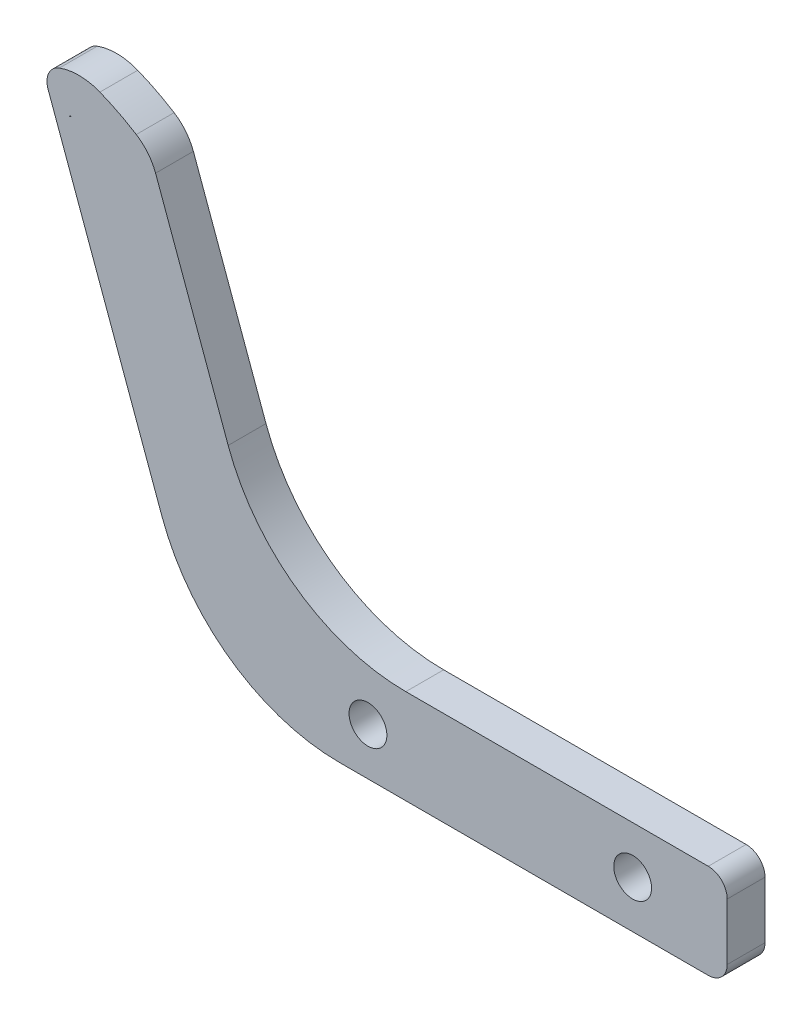
ISO-10303-21;
HEADER;
FILE_DESCRIPTION(('STEP AP214'),'2;1');
FILE_NAME('part.step','',(''),(''),'','','');
FILE_SCHEMA(('AUTOMOTIVE_DESIGN { 1 0 10303 214 1 1 1 1 }'));
ENDSEC;
DATA;
#1=APPLICATION_CONTEXT('core data for automotive mechanical design processes');
#2=APPLICATION_PROTOCOL_DEFINITION('international standard','automotive_design',2000,#1);
#3=PRODUCT_CONTEXT('',#1,'mechanical');
#4=PRODUCT('Part','Part','',(#3));
#5=PRODUCT_RELATED_PRODUCT_CATEGORY('part','',(#4));
#6=PRODUCT_DEFINITION_FORMATION('','',#4);
#7=PRODUCT_DEFINITION_CONTEXT('part definition',#1,'design');
#8=PRODUCT_DEFINITION('design','',#6,#7);
#9=PRODUCT_DEFINITION_SHAPE('','',#8);
#10=(LENGTH_UNIT() NAMED_UNIT(*) SI_UNIT(.MILLI.,.METRE.));
#11=(NAMED_UNIT(*) PLANE_ANGLE_UNIT() SI_UNIT($,.RADIAN.));
#12=(NAMED_UNIT(*) SI_UNIT($,.STERADIAN.) SOLID_ANGLE_UNIT());
#13=UNCERTAINTY_MEASURE_WITH_UNIT(LENGTH_MEASURE(1.E-05),#10,'distance_accuracy_value','');
#14=(GEOMETRIC_REPRESENTATION_CONTEXT(3) GLOBAL_UNCERTAINTY_ASSIGNED_CONTEXT((#13)) GLOBAL_UNIT_ASSIGNED_CONTEXT((#10,
#11,#12)) REPRESENTATION_CONTEXT('',''));
#15=CARTESIAN_POINT('',(0.,0.,0.));
#16=DIRECTION('',(0.,0.,1.));
#17=DIRECTION('',(1.,0.,0.));
#18=AXIS2_PLACEMENT_3D('',#15,#16,#17);
#19=CARTESIAN_POINT('',(-58.5846758968649,38.1711990775723,-4.));
#20=DIRECTION('',(0.,0.,1.));
#21=DIRECTION('',(-1.,0.,0.));
#22=AXIS2_PLACEMENT_3D('',#19,#20,#21);
#23=CYLINDRICAL_SURFACE('',#22,2.);
#24=CARTESIAN_POINT('',(-58.5846758968649,38.1711990775723,0.));
#25=DIRECTION('',(0.,0.,1.));
#26=DIRECTION('',(1.,0.,0.));
#27=AXIS2_PLACEMENT_3D('',#24,#25,#26);
#28=CIRCLE('',#27,2.);
#29=CARTESIAN_POINT('',(-59.572682652042,39.9101190445991,0.));
#30=VERTEX_POINT('',#29);
#31=CARTESIAN_POINT('',(-59.2687161835162,40.0505843191441,0.));
#32=VERTEX_POINT('',#31);
#33=EDGE_CURVE('E172',#30,#32,#28,.F.);
#34=ORIENTED_EDGE('',*,*,#33,.T.);
#35=DIRECTION('',(0.,0.,-1.));
#36=VECTOR('',#35,1.);
#37=CARTESIAN_POINT('',(-59.2687161835162,40.0505843191441,0.));
#38=LINE('',#37,#36);
#39=CARTESIAN_POINT('',(-59.2687161835162,40.0505843191441,-4.));
#40=VERTEX_POINT('',#39);
#41=EDGE_CURVE('E159',#32,#40,#38,.T.);
#42=ORIENTED_EDGE('',*,*,#41,.T.);
#43=CARTESIAN_POINT('',(-58.5846758968649,38.1711990775723,-4.));
#44=DIRECTION('',(0.,0.,1.));
#45=DIRECTION('',(1.,0.,0.));
#46=AXIS2_PLACEMENT_3D('',#43,#44,#45);
#47=CIRCLE('',#46,2.);
#48=CARTESIAN_POINT('',(-59.572682652042,39.9101190445991,-4.));
#49=VERTEX_POINT('',#48);
#50=EDGE_CURVE('E287',#40,#49,#47,.T.);
#51=ORIENTED_EDGE('',*,*,#50,.T.);
#52=DIRECTION('',(0.,0.,-1.));
#53=VECTOR('',#52,1.);
#54=CARTESIAN_POINT('',(-59.572682652042,39.9101190445991,0.));
#55=LINE('',#54,#53);
#56=EDGE_CURVE('E197',#30,#49,#55,.T.);
#57=ORIENTED_EDGE('',*,*,#56,.F.);
#58=EDGE_LOOP('',(#34,#42,#51,#57));
#59=FACE_BOUND('',#58,.T.);
#60=ADVANCED_FACE('F39',(#59),#23,.T.);
#61=CARTESIAN_POINT('',(-31.9460427865344,-11.6274086768929,-4.));
#62=DIRECTION('',(0.93969262078591,0.342020143325665,0.));
#63=DIRECTION('',(-0.342020143325665,0.93969262078591,0.));
#64=AXIS2_PLACEMENT_3D('',#61,#62,#63);
#65=PLANE('',#64);
#66=DIRECTION('',(0.342020143325665,-0.93969262078591,0.));
#67=VECTOR('',#66,1.);
#68=CARTESIAN_POINT('',(-31.9460427865344,-11.6274086768929,0.));
#69=LINE('',#68,#67);
#70=CARTESIAN_POINT('',(-50.4670591952752,39.2586656914718,0.));
#71=VERTEX_POINT('',#70);
#72=CARTESIAN_POINT('',(-42.7876262694269,18.1595971334867,0.));
#73=VERTEX_POINT('',#72);
#74=EDGE_CURVE('E233',#71,#73,#69,.T.);
#75=ORIENTED_EDGE('',*,*,#74,.T.);
#76=DIRECTION('',(0.,0.,1.));
#77=VECTOR('',#76,1.);
#78=CARTESIAN_POINT('',(-42.7876262694268,18.1595971334867,0.));
#79=LINE('',#78,#77);
#80=CARTESIAN_POINT('',(-42.7876262694269,18.1595971334867,-4.));
#81=VERTEX_POINT('',#80);
#82=EDGE_CURVE('E264',#81,#73,#79,.T.);
#83=ORIENTED_EDGE('',*,*,#82,.F.);
#84=DIRECTION('',(0.342020143325665,-0.93969262078591,0.));
#85=VECTOR('',#84,1.);
#86=CARTESIAN_POINT('',(-31.9460427865344,-11.6274086768929,-4.));
#87=LINE('',#86,#85);
#88=CARTESIAN_POINT('',(-50.4670591952752,39.2586656914718,-4.));
#89=VERTEX_POINT('',#88);
#90=EDGE_CURVE('E213',#89,#81,#87,.T.);
#91=ORIENTED_EDGE('',*,*,#90,.F.);
#92=DIRECTION('',(0.,0.,-1.));
#93=VECTOR('',#92,1.);
#94=CARTESIAN_POINT('',(-50.4670591952752,39.2586656914718,0.));
#95=LINE('',#94,#93);
#96=EDGE_CURVE('E209',#71,#89,#95,.T.);
#97=ORIENTED_EDGE('',*,*,#96,.F.);
#98=EDGE_LOOP('',(#75,#83,#91,#97));
#99=FACE_BOUND('',#98,.T.);
#100=ADVANCED_FACE('F334',(#99),#65,.T.);
#101=CARTESIAN_POINT('',(-41.3429689943934,-15.0476101101496,-4.));
#102=DIRECTION('',(0.939692620785909,0.342020143325666,0.));
#103=DIRECTION('',(-0.342020143325666,0.939692620785909,0.));
#104=AXIS2_PLACEMENT_3D('',#101,#102,#103);
#105=PLANE('',#104);
#106=DIRECTION('',(0.342020143325666,-0.939692620785909,0.));
#107=VECTOR('',#106,1.);
#108=CARTESIAN_POINT('',(-41.3429689943934,-15.0476101101496,-4.));
#109=LINE('',#108,#107);
#110=CARTESIAN_POINT('',(-61.8321417117394,41.2459292740646,-4.));
#111=VERTEX_POINT('',#110);
#112=CARTESIAN_POINT('',(-49.789701651524,8.15959713348668,-4.));
#113=VERTEX_POINT('',#112);
#114=EDGE_CURVE('E216',#111,#113,#109,.T.);
#115=ORIENTED_EDGE('',*,*,#114,.T.);
#116=DIRECTION('',(0.,0.,1.));
#117=VECTOR('',#116,1.);
#118=CARTESIAN_POINT('',(-49.789701651524,8.15959713348668,-4.));
#119=LINE('',#118,#117);
#120=CARTESIAN_POINT('',(-49.789701651524,8.15959713348668,0.));
#121=VERTEX_POINT('',#120);
#122=EDGE_CURVE('E259',#121,#113,#119,.F.);
#123=ORIENTED_EDGE('',*,*,#122,.F.);
#124=DIRECTION('',(0.342020143325666,-0.939692620785909,0.));
#125=VECTOR('',#124,1.);
#126=CARTESIAN_POINT('',(-41.3429689943934,-15.0476101101496,0.));
#127=LINE('',#126,#125);
#128=CARTESIAN_POINT('',(-61.8321417117394,41.2459292740646,0.));
#129=VERTEX_POINT('',#128);
#130=EDGE_CURVE('E236',#129,#121,#127,.T.);
#131=ORIENTED_EDGE('',*,*,#130,.F.);
#132=DIRECTION('',(0.,0.,-1.));
#133=VECTOR('',#132,1.);
#134=CARTESIAN_POINT('',(-61.8321417117394,41.2459292740646,0.));
#135=LINE('',#134,#133);
#136=EDGE_CURVE('E200',#129,#111,#135,.T.);
#137=ORIENTED_EDGE('',*,*,#136,.T.);
#138=EDGE_LOOP('',(#115,#123,#131,#137));
#139=FACE_BOUND('',#138,.T.);
#140=ADVANCED_FACE('F315',(#139),#105,.F.);
#141=CARTESIAN_POINT('',(0.,-5.,-4.));
#142=DIRECTION('',(0.,1.,0.));
#143=DIRECTION('',(0.,0.,-1.));
#144=AXIS2_PLACEMENT_3D('',#141,#142,#143);
#145=PLANE('',#144);
#146=DIRECTION('',(1.,0.,0.));
#147=VECTOR('',#146,1.);
#148=CARTESIAN_POINT('',(0.,-5.,0.));
#149=LINE('',#148,#147);
#150=CARTESIAN_POINT('',(-30.9958492358058,-5.,0.));
#151=VERTEX_POINT('',#150);
#152=CARTESIAN_POINT('',(8.,-5.,0.));
#153=VERTEX_POINT('',#152);
#154=EDGE_CURVE('E240',#151,#153,#149,.T.);
#155=ORIENTED_EDGE('',*,*,#154,.F.);
#156=DIRECTION('',(0.,0.,1.));
#157=VECTOR('',#156,1.);
#158=CARTESIAN_POINT('',(-30.9958492358058,-5.,-4.));
#159=LINE('',#158,#157);
#160=CARTESIAN_POINT('',(-30.9958492358058,-5.,-4.));
#161=VERTEX_POINT('',#160);
#162=EDGE_CURVE('E232',#161,#151,#159,.T.);
#163=ORIENTED_EDGE('',*,*,#162,.F.);
#164=DIRECTION('',(1.,0.,0.));
#165=VECTOR('',#164,1.);
#166=CARTESIAN_POINT('',(0.,-5.,-4.));
#167=LINE('',#166,#165);
#168=CARTESIAN_POINT('',(8.,-5.,-4.));
#169=VERTEX_POINT('',#168);
#170=EDGE_CURVE('E220',#161,#169,#167,.T.);
#171=ORIENTED_EDGE('',*,*,#170,.T.);
#172=DIRECTION('',(0.,0.,1.));
#173=VECTOR('',#172,1.);
#174=CARTESIAN_POINT('',(8.,-5.,-4.));
#175=LINE('',#174,#173);
#176=EDGE_CURVE('E284',#153,#169,#175,.F.);
#177=ORIENTED_EDGE('',*,*,#176,.F.);
#178=EDGE_LOOP('',(#155,#163,#171,#177));
#179=FACE_BOUND('',#178,.T.);
#180=ADVANCED_FACE('F307',(#179),#145,.F.);
#181=CARTESIAN_POINT('',(-28.,0.,-4.));
#182=DIRECTION('',(0.,0.,1.));
#183=DIRECTION('',(-1.,0.,0.));
#184=AXIS2_PLACEMENT_3D('',#181,#182,#183);
#185=CYLINDRICAL_SURFACE('',#184,2.);
#186=CARTESIAN_POINT('',(-28.,0.,-4.));
#187=DIRECTION('',(0.,0.,1.));
#188=DIRECTION('',(1.,0.,0.));
#189=AXIS2_PLACEMENT_3D('',#186,#187,#188);
#190=CIRCLE('',#189,2.);
#191=CARTESIAN_POINT('',(-26.,0.,-4.));
#192=VERTEX_POINT('',#191);
#193=EDGE_CURVE('E226',#192,#192,#190,.T.);
#194=ORIENTED_EDGE('',*,*,#193,.F.);
#195=EDGE_LOOP('',(#194));
#196=FACE_BOUND('',#195,.T.);
#197=CARTESIAN_POINT('',(-28.,0.,0.));
#198=DIRECTION('',(0.,0.,1.));
#199=DIRECTION('',(1.,0.,0.));
#200=AXIS2_PLACEMENT_3D('',#197,#198,#199);
#201=CIRCLE('',#200,2.);
#202=CARTESIAN_POINT('',(-26.,0.,0.));
#203=VERTEX_POINT('',#202);
#204=EDGE_CURVE('E246',#203,#203,#201,.T.);
#205=ORIENTED_EDGE('',*,*,#204,.T.);
#206=EDGE_LOOP('',(#205));
#207=FACE_BOUND('',#206,.T.);
#208=ADVANCED_FACE('F377',(#196,#207),#185,.F.);
#209=CARTESIAN_POINT('',(0.,5.,-4.));
#210=DIRECTION('',(0.,1.,0.));
#211=DIRECTION('',(0.,0.,-1.));
#212=AXIS2_PLACEMENT_3D('',#209,#210,#211);
#213=PLANE('',#212);
#214=DIRECTION('',(1.,0.,0.));
#215=VECTOR('',#214,1.);
#216=CARTESIAN_POINT('',(0.,5.,-4.));
#217=LINE('',#216,#215);
#218=CARTESIAN_POINT('',(-23.9937738537087,5.,-4.));
#219=VERTEX_POINT('',#218);
#220=CARTESIAN_POINT('',(8.,5.,-4.));
#221=VERTEX_POINT('',#220);
#222=EDGE_CURVE('E223',#219,#221,#217,.T.);
#223=ORIENTED_EDGE('',*,*,#222,.F.);
#224=DIRECTION('',(0.,0.,1.));
#225=VECTOR('',#224,1.);
#226=CARTESIAN_POINT('',(-23.9937738537087,5.,-4.));
#227=LINE('',#226,#225);
#228=CARTESIAN_POINT('',(-23.9937738537087,5.,0.));
#229=VERTEX_POINT('',#228);
#230=EDGE_CURVE('E267',#229,#219,#227,.F.);
#231=ORIENTED_EDGE('',*,*,#230,.F.);
#232=DIRECTION('',(1.,0.,0.));
#233=VECTOR('',#232,1.);
#234=CARTESIAN_POINT('',(0.,5.,0.));
#235=LINE('',#234,#233);
#236=CARTESIAN_POINT('',(8.,5.,0.));
#237=VERTEX_POINT('',#236);
#238=EDGE_CURVE('E243',#229,#237,#235,.T.);
#239=ORIENTED_EDGE('',*,*,#238,.T.);
#240=DIRECTION('',(0.,0.,1.));
#241=VECTOR('',#240,1.);
#242=CARTESIAN_POINT('',(8.,5.,-4.));
#243=LINE('',#242,#241);
#244=EDGE_CURVE('E11',#221,#237,#243,.T.);
#245=ORIENTED_EDGE('',*,*,#244,.F.);
#246=EDGE_LOOP('',(#223,#231,#239,#245));
#247=FACE_BOUND('',#246,.T.);
#248=ADVANCED_FACE('F342',(#247),#213,.T.);
#249=CARTESIAN_POINT('',(0.,0.,-4.));
#250=DIRECTION('',(0.,0.,1.));
#251=DIRECTION('',(-1.,0.,0.));
#252=AXIS2_PLACEMENT_3D('',#249,#250,#251);
#253=CYLINDRICAL_SURFACE('',#252,2.);
#254=CARTESIAN_POINT('',(0.,0.,-4.));
#255=DIRECTION('',(0.,0.,1.));
#256=DIRECTION('',(1.,0.,0.));
#257=AXIS2_PLACEMENT_3D('',#254,#255,#256);
#258=CIRCLE('',#257,2.);
#259=CARTESIAN_POINT('',(2.,0.,-4.));
#260=VERTEX_POINT('',#259);
#261=EDGE_CURVE('E229',#260,#260,#258,.T.);
#262=ORIENTED_EDGE('',*,*,#261,.F.);
#263=EDGE_LOOP('',(#262));
#264=FACE_BOUND('',#263,.T.);
#265=CARTESIAN_POINT('',(0.,0.,0.));
#266=DIRECTION('',(0.,0.,1.));
#267=DIRECTION('',(1.,0.,0.));
#268=AXIS2_PLACEMENT_3D('',#265,#266,#267);
#269=CIRCLE('',#268,2.);
#270=CARTESIAN_POINT('',(2.,0.,0.));
#271=VERTEX_POINT('',#270);
#272=EDGE_CURVE('E217',#271,#271,#269,.T.);
#273=ORIENTED_EDGE('',*,*,#272,.T.);
#274=EDGE_LOOP('',(#273));
#275=FACE_BOUND('',#274,.T.);
#276=ADVANCED_FACE('F359',(#264,#275),#253,.F.);
#277=CARTESIAN_POINT('',(0.,0.,-4.));
#278=DIRECTION('',(0.,0.,-1.));
#279=DIRECTION('',(1.,0.,0.));
#280=AXIS2_PLACEMENT_3D('',#277,#278,#279);
#281=PLANE('',#280);
#282=CARTESIAN_POINT('',(-59.9527564701676,41.929969560716,-4.));
#283=DIRECTION('',(0.,0.,1.));
#284=DIRECTION('',(1.,0.,0.));
#285=AXIS2_PLACEMENT_3D('',#282,#283,#284);
#286=CIRCLE('',#285,2.);
#287=CARTESIAN_POINT('',(-60.6367967568189,43.8093548022878,-4.));
#288=VERTEX_POINT('',#287);
#289=EDGE_CURVE('E173',#288,#111,#286,.T.);
#290=ORIENTED_EDGE('',*,*,#289,.F.);
#291=CARTESIAN_POINT('',(-58.5846758968649,38.1711990775723,-4.));
#292=DIRECTION('',(0.,0.,1.));
#293=DIRECTION('',(1.,0.,0.));
#294=AXIS2_PLACEMENT_3D('',#291,#292,#293);
#295=CIRCLE('',#294,6.);
#296=CARTESIAN_POINT('',(-56.3554659940221,43.7417128069394,-4.));
#297=VERTEX_POINT('',#296);
#298=EDGE_CURVE('E175',#297,#288,#295,.T.);
#299=ORIENTED_EDGE('',*,*,#298,.F.);
#300=CARTESIAN_POINT('',(-65.2723056053933,21.459657889471,-4.));
#301=DIRECTION('',(0.,0.,1.));
#302=DIRECTION('',(1.,0.,0.));
#303=AXIS2_PLACEMENT_3D('',#300,#301,#302);
#304=CIRCLE('',#303,24.);
#305=CARTESIAN_POINT('',(-52.5058424817868,41.7824878920467,-4.));
#306=VERTEX_POINT('',#305);
#307=EDGE_CURVE('E192',#306,#297,#304,.T.);
#308=ORIENTED_EDGE('',*,*,#307,.F.);
#309=CARTESIAN_POINT('',(-55.1655222992048,37.5485649748434,-4.));
#310=DIRECTION('',(0.,0.,1.));
#311=DIRECTION('',(1.,0.,0.));
#312=AXIS2_PLACEMENT_3D('',#309,#310,#311);
#313=CIRCLE('',#312,5.);
#314=EDGE_CURVE('E189',#89,#306,#313,.T.);
#315=ORIENTED_EDGE('',*,*,#314,.F.);
#316=ORIENTED_EDGE('',*,*,#90,.T.);
#317=CARTESIAN_POINT('',(-23.9937738537087,25.,-4.));
#318=DIRECTION('',(0.,0.,1.));
#319=DIRECTION('',(1.,0.,0.));
#320=AXIS2_PLACEMENT_3D('',#317,#318,#319);
#321=CIRCLE('',#320,20.);
#322=EDGE_CURVE('E272',#219,#81,#321,.F.);
#323=ORIENTED_EDGE('',*,*,#322,.F.);
#324=ORIENTED_EDGE('',*,*,#222,.T.);
#325=CARTESIAN_POINT('',(8.,3.,-4.));
#326=DIRECTION('',(0.,0.,1.));
#327=DIRECTION('',(1.,0.,0.));
#328=AXIS2_PLACEMENT_3D('',#325,#326,#327);
#329=CIRCLE('',#328,2.);
#330=CARTESIAN_POINT('',(10.,3.,-4.));
#331=VERTEX_POINT('',#330);
#332=EDGE_CURVE('E60',#331,#221,#329,.T.);
#333=ORIENTED_EDGE('',*,*,#332,.F.);
#334=DIRECTION('',(0.,-1.,0.));
#335=VECTOR('',#334,1.);
#336=CARTESIAN_POINT('',(10.,5.,-4.));
#337=LINE('',#336,#335);
#338=CARTESIAN_POINT('',(10.,-3.,-4.));
#339=VERTEX_POINT('',#338);
#340=EDGE_CURVE('E237',#331,#339,#337,.T.);
#341=ORIENTED_EDGE('',*,*,#340,.T.);
#342=CARTESIAN_POINT('',(8.,-3.,-4.));
#343=DIRECTION('',(0.,0.,1.));
#344=DIRECTION('',(1.,0.,0.));
#345=AXIS2_PLACEMENT_3D('',#342,#343,#344);
#346=CIRCLE('',#345,2.);
#347=EDGE_CURVE('E46',#169,#339,#346,.T.);
#348=ORIENTED_EDGE('',*,*,#347,.F.);
#349=ORIENTED_EDGE('',*,*,#170,.F.);
#350=CARTESIAN_POINT('',(-30.9958492358058,15.,-4.));
#351=DIRECTION('',(0.,0.,1.));
#352=DIRECTION('',(1.,0.,0.));
#353=AXIS2_PLACEMENT_3D('',#350,#351,#352);
#354=CIRCLE('',#353,20.);
#355=EDGE_CURVE('E262',#113,#161,#354,.T.);
#356=ORIENTED_EDGE('',*,*,#355,.F.);
#357=ORIENTED_EDGE('',*,*,#114,.F.);
#358=EDGE_LOOP('',(#290,#299,#308,#315,#316,#323,#324,#333,#341,#348,#349,#356,#357));
#359=FACE_BOUND('',#358,.T.);
#360=ORIENTED_EDGE('',*,*,#50,.F.);
#361=CARTESIAN_POINT('',(-59.9527564701676,41.929969560716,-4.));
#362=DIRECTION('',(0.,0.,1.));
#363=DIRECTION('',(1.,0.,0.));
#364=AXIS2_PLACEMENT_3D('',#361,#362,#363);
#365=CIRCLE('',#364,2.);
#366=CARTESIAN_POINT('',(-59.5381790307102,39.9734099406959,-4.));
#367=VERTEX_POINT('',#366);
#368=EDGE_CURVE('E53',#367,#40,#365,.T.);
#369=ORIENTED_EDGE('',*,*,#368,.F.);
#370=CARTESIAN_POINT('',(-55.1655222992048,37.5485649748434,-4.));
#371=DIRECTION('',(0.,0.,1.));
#372=DIRECTION('',(1.,0.,0.));
#373=AXIS2_PLACEMENT_3D('',#370,#371,#372);
#374=CIRCLE('',#373,5.);
#375=EDGE_CURVE('E158',#367,#49,#374,.T.);
#376=ORIENTED_EDGE('',*,*,#375,.T.);
#377=EDGE_LOOP('',(#360,#369,#376));
#378=FACE_BOUND('',#377,.T.);
#379=ORIENTED_EDGE('',*,*,#193,.T.);
#380=EDGE_LOOP('',(#379));
#381=FACE_BOUND('',#380,.T.);
#382=ORIENTED_EDGE('',*,*,#261,.T.);
#383=EDGE_LOOP('',(#382));
#384=FACE_BOUND('',#383,.T.);
#385=ADVANCED_FACE('F298',(#359,#378,#381,#384),#281,.T.);
#386=CARTESIAN_POINT('',(0.,0.,0.));
#387=DIRECTION('',(0.,0.,-1.));
#388=DIRECTION('',(1.,0.,0.));
#389=AXIS2_PLACEMENT_3D('',#386,#387,#388);
#390=PLANE('',#389);
#391=CARTESIAN_POINT('',(-55.1655222992048,37.5485649748434,0.));
#392=DIRECTION('',(0.,0.,1.));
#393=DIRECTION('',(1.,0.,0.));
#394=AXIS2_PLACEMENT_3D('',#391,#392,#393);
#395=CIRCLE('',#394,5.);
#396=CARTESIAN_POINT('',(-52.5058424817868,41.7824878920467,0.));
#397=VERTEX_POINT('',#396);
#398=EDGE_CURVE('E168',#71,#397,#395,.T.);
#399=ORIENTED_EDGE('',*,*,#398,.T.);
#400=CARTESIAN_POINT('',(-65.2723056053933,21.459657889471,0.));
#401=DIRECTION('',(0.,0.,1.));
#402=DIRECTION('',(1.,0.,0.));
#403=AXIS2_PLACEMENT_3D('',#400,#401,#402);
#404=CIRCLE('',#403,24.);
#405=CARTESIAN_POINT('',(-56.3554659940221,43.7417128069394,0.));
#406=VERTEX_POINT('',#405);
#407=EDGE_CURVE('E180',#397,#406,#404,.T.);
#408=ORIENTED_EDGE('',*,*,#407,.T.);
#409=CARTESIAN_POINT('',(-58.5846758968649,38.1711990775723,0.));
#410=DIRECTION('',(0.,0.,1.));
#411=DIRECTION('',(1.,0.,0.));
#412=AXIS2_PLACEMENT_3D('',#409,#410,#411);
#413=CIRCLE('',#412,6.);
#414=CARTESIAN_POINT('',(-60.6367967568189,43.8093548022878,0.));
#415=VERTEX_POINT('',#414);
#416=EDGE_CURVE('E183',#406,#415,#413,.T.);
#417=ORIENTED_EDGE('',*,*,#416,.T.);
#418=CARTESIAN_POINT('',(-59.9527564701676,41.929969560716,0.));
#419=DIRECTION('',(0.,0.,1.));
#420=DIRECTION('',(1.,0.,0.));
#421=AXIS2_PLACEMENT_3D('',#418,#419,#420);
#422=CIRCLE('',#421,2.);
#423=EDGE_CURVE('E160',#415,#129,#422,.T.);
#424=ORIENTED_EDGE('',*,*,#423,.T.);
#425=ORIENTED_EDGE('',*,*,#130,.T.);
#426=CARTESIAN_POINT('',(-30.9958492358058,15.,0.));
#427=DIRECTION('',(0.,0.,1.));
#428=DIRECTION('',(1.,0.,0.));
#429=AXIS2_PLACEMENT_3D('',#426,#427,#428);
#430=CIRCLE('',#429,20.);
#431=EDGE_CURVE('E257',#151,#121,#430,.F.);
#432=ORIENTED_EDGE('',*,*,#431,.F.);
#433=ORIENTED_EDGE('',*,*,#154,.T.);
#434=CARTESIAN_POINT('',(8.,-3.,0.));
#435=DIRECTION('',(0.,0.,1.));
#436=DIRECTION('',(1.,0.,0.));
#437=AXIS2_PLACEMENT_3D('',#434,#435,#436);
#438=CIRCLE('',#437,2.);
#439=CARTESIAN_POINT('',(10.,-3.,0.));
#440=VERTEX_POINT('',#439);
#441=EDGE_CURVE('E282',#440,#153,#438,.F.);
#442=ORIENTED_EDGE('',*,*,#441,.F.);
#443=DIRECTION('',(0.,-1.,0.));
#444=VECTOR('',#443,1.);
#445=CARTESIAN_POINT('',(10.,5.,0.));
#446=LINE('',#445,#444);
#447=CARTESIAN_POINT('',(10.,3.,0.));
#448=VERTEX_POINT('',#447);
#449=EDGE_CURVE('E199',#448,#440,#446,.T.);
#450=ORIENTED_EDGE('',*,*,#449,.F.);
#451=CARTESIAN_POINT('',(8.,3.,0.));
#452=DIRECTION('',(0.,0.,1.));
#453=DIRECTION('',(1.,0.,0.));
#454=AXIS2_PLACEMENT_3D('',#451,#452,#453);
#455=CIRCLE('',#454,2.);
#456=EDGE_CURVE('E279',#237,#448,#455,.F.);
#457=ORIENTED_EDGE('',*,*,#456,.F.);
#458=ORIENTED_EDGE('',*,*,#238,.F.);
#459=CARTESIAN_POINT('',(-23.9937738537087,25.,0.));
#460=DIRECTION('',(0.,0.,1.));
#461=DIRECTION('',(1.,0.,0.));
#462=AXIS2_PLACEMENT_3D('',#459,#460,#461);
#463=CIRCLE('',#462,20.);
#464=EDGE_CURVE('E270',#73,#229,#463,.T.);
#465=ORIENTED_EDGE('',*,*,#464,.F.);
#466=ORIENTED_EDGE('',*,*,#74,.F.);
#467=EDGE_LOOP('',(#399,#408,#417,#424,#425,#432,#433,#442,#450,#457,#458,#465,#466));
#468=FACE_BOUND('',#467,.T.);
#469=CARTESIAN_POINT('',(-55.1655222992048,37.5485649748434,0.));
#470=DIRECTION('',(0.,0.,1.));
#471=DIRECTION('',(1.,0.,0.));
#472=AXIS2_PLACEMENT_3D('',#469,#470,#471);
#473=CIRCLE('',#472,5.);
#474=CARTESIAN_POINT('',(-59.5381790307102,39.9734099406959,0.));
#475=VERTEX_POINT('',#474);
#476=EDGE_CURVE('E156',#475,#30,#473,.T.);
#477=ORIENTED_EDGE('',*,*,#476,.F.);
#478=CARTESIAN_POINT('',(-59.9527564701676,41.929969560716,0.));
#479=DIRECTION('',(0.,0.,1.));
#480=DIRECTION('',(1.,0.,0.));
#481=AXIS2_PLACEMENT_3D('',#478,#479,#480);
#482=CIRCLE('',#481,2.);
#483=EDGE_CURVE('E162',#475,#32,#482,.T.);
#484=ORIENTED_EDGE('',*,*,#483,.T.);
#485=ORIENTED_EDGE('',*,*,#33,.F.);
#486=EDGE_LOOP('',(#477,#484,#485));
#487=FACE_BOUND('',#486,.T.);
#488=ORIENTED_EDGE('',*,*,#204,.F.);
#489=EDGE_LOOP('',(#488));
#490=FACE_BOUND('',#489,.T.);
#491=ORIENTED_EDGE('',*,*,#272,.F.);
#492=EDGE_LOOP('',(#491));
#493=FACE_BOUND('',#492,.T.);
#494=ADVANCED_FACE('F170',(#468,#487,#490,#493),#390,.F.);
#495=CARTESIAN_POINT('',(10.,5.,-4.));
#496=DIRECTION('',(1.,0.,0.));
#497=DIRECTION('',(0.,0.,1.));
#498=AXIS2_PLACEMENT_3D('',#495,#496,#497);
#499=PLANE('',#498);
#500=ORIENTED_EDGE('',*,*,#340,.F.);
#501=DIRECTION('',(0.,0.,1.));
#502=VECTOR('',#501,1.);
#503=CARTESIAN_POINT('',(10.,3.,-4.));
#504=LINE('',#503,#502);
#505=EDGE_CURVE('E274',#448,#331,#504,.F.);
#506=ORIENTED_EDGE('',*,*,#505,.F.);
#507=ORIENTED_EDGE('',*,*,#449,.T.);
#508=DIRECTION('',(0.,0.,1.));
#509=VECTOR('',#508,1.);
#510=CARTESIAN_POINT('',(10.,-3.,0.));
#511=LINE('',#510,#509);
#512=EDGE_CURVE('E276',#339,#440,#511,.T.);
#513=ORIENTED_EDGE('',*,*,#512,.F.);
#514=EDGE_LOOP('',(#500,#506,#507,#513));
#515=FACE_BOUND('',#514,.T.);
#516=ADVANCED_FACE('F301',(#515),#499,.T.);
#517=CARTESIAN_POINT('',(-30.9958492358058,15.,-4.));
#518=DIRECTION('',(0.,0.,1.));
#519=DIRECTION('',(-1.,0.,0.));
#520=AXIS2_PLACEMENT_3D('',#517,#518,#519);
#521=CYLINDRICAL_SURFACE('',#520,20.);
#522=ORIENTED_EDGE('',*,*,#355,.T.);
#523=ORIENTED_EDGE('',*,*,#162,.T.);
#524=ORIENTED_EDGE('',*,*,#431,.T.);
#525=ORIENTED_EDGE('',*,*,#122,.T.);
#526=EDGE_LOOP('',(#522,#523,#524,#525));
#527=FACE_BOUND('',#526,.T.);
#528=ADVANCED_FACE('F312',(#527),#521,.T.);
#529=CARTESIAN_POINT('',(-23.9937738537087,25.,-4.));
#530=DIRECTION('',(0.,0.,-1.));
#531=DIRECTION('',(1.,0.,0.));
#532=AXIS2_PLACEMENT_3D('',#529,#530,#531);
#533=CYLINDRICAL_SURFACE('',#532,20.);
#534=ORIENTED_EDGE('',*,*,#322,.T.);
#535=ORIENTED_EDGE('',*,*,#82,.T.);
#536=ORIENTED_EDGE('',*,*,#464,.T.);
#537=ORIENTED_EDGE('',*,*,#230,.T.);
#538=EDGE_LOOP('',(#534,#535,#536,#537));
#539=FACE_BOUND('',#538,.T.);
#540=ADVANCED_FACE('F337',(#539),#533,.F.);
#541=CARTESIAN_POINT('',(8.,-3.,-4.));
#542=DIRECTION('',(0.,0.,-1.));
#543=DIRECTION('',(1.,0.,0.));
#544=AXIS2_PLACEMENT_3D('',#541,#542,#543);
#545=CYLINDRICAL_SURFACE('',#544,2.);
#546=ORIENTED_EDGE('',*,*,#347,.T.);
#547=ORIENTED_EDGE('',*,*,#512,.T.);
#548=ORIENTED_EDGE('',*,*,#441,.T.);
#549=ORIENTED_EDGE('',*,*,#176,.T.);
#550=EDGE_LOOP('',(#546,#547,#548,#549));
#551=FACE_BOUND('',#550,.T.);
#552=ADVANCED_FACE('F292',(#551),#545,.T.);
#553=CARTESIAN_POINT('',(8.,3.,-4.));
#554=DIRECTION('',(0.,0.,1.));
#555=DIRECTION('',(-1.,0.,0.));
#556=AXIS2_PLACEMENT_3D('',#553,#554,#555);
#557=CYLINDRICAL_SURFACE('',#556,2.);
#558=ORIENTED_EDGE('',*,*,#332,.T.);
#559=ORIENTED_EDGE('',*,*,#244,.T.);
#560=ORIENTED_EDGE('',*,*,#456,.T.);
#561=ORIENTED_EDGE('',*,*,#505,.T.);
#562=EDGE_LOOP('',(#558,#559,#560,#561));
#563=FACE_BOUND('',#562,.T.);
#564=ADVANCED_FACE('F343',(#563),#557,.T.);
#565=CARTESIAN_POINT('',(-55.1655222992048,37.5485649748434,0.));
#566=DIRECTION('',(0.,0.,-1.));
#567=DIRECTION('',(1.,0.,0.));
#568=AXIS2_PLACEMENT_3D('',#565,#566,#567);
#569=CYLINDRICAL_SURFACE('',#568,5.);
#570=ORIENTED_EDGE('',*,*,#375,.F.);
#571=DIRECTION('',(0.,0.,-1.));
#572=VECTOR('',#571,1.);
#573=CARTESIAN_POINT('',(-59.5381790307102,39.9734099406959,0.));
#574=LINE('',#573,#572);
#575=EDGE_CURVE('E151',#475,#367,#574,.T.);
#576=ORIENTED_EDGE('',*,*,#575,.F.);
#577=ORIENTED_EDGE('',*,*,#476,.T.);
#578=ORIENTED_EDGE('',*,*,#56,.T.);
#579=EDGE_LOOP('',(#570,#576,#577,#578));
#580=FACE_BOUND('',#579,.T.);
#581=ADVANCED_FACE('F153',(#580),#569,.F.);
#582=CARTESIAN_POINT('',(-59.9527564701676,41.929969560716,0.));
#583=DIRECTION('',(0.,0.,-1.));
#584=DIRECTION('',(1.,0.,0.));
#585=AXIS2_PLACEMENT_3D('',#582,#583,#584);
#586=CYLINDRICAL_SURFACE('',#585,2.);
#587=ORIENTED_EDGE('',*,*,#289,.T.);
#588=ORIENTED_EDGE('',*,*,#136,.F.);
#589=ORIENTED_EDGE('',*,*,#423,.F.);
#590=DIRECTION('',(0.,0.,-1.));
#591=VECTOR('',#590,1.);
#592=CARTESIAN_POINT('',(-60.6367967568189,43.8093548022878,0.));
#593=LINE('',#592,#591);
#594=EDGE_CURVE('E203',#415,#288,#593,.T.);
#595=ORIENTED_EDGE('',*,*,#594,.T.);
#596=EDGE_LOOP('',(#587,#588,#589,#595));
#597=FACE_BOUND('',#596,.T.);
#598=ADVANCED_FACE('F319',(#597),#586,.T.);
#599=CARTESIAN_POINT('',(-58.5846758968649,38.1711990775723,0.));
#600=DIRECTION('',(0.,0.,-1.));
#601=DIRECTION('',(1.,0.,0.));
#602=AXIS2_PLACEMENT_3D('',#599,#600,#601);
#603=CYLINDRICAL_SURFACE('',#602,6.);
#604=ORIENTED_EDGE('',*,*,#298,.T.);
#605=ORIENTED_EDGE('',*,*,#594,.F.);
#606=ORIENTED_EDGE('',*,*,#416,.F.);
#607=DIRECTION('',(0.,0.,-1.));
#608=VECTOR('',#607,1.);
#609=CARTESIAN_POINT('',(-56.3554659940221,43.7417128069394,0.));
#610=LINE('',#609,#608);
#611=EDGE_CURVE('E205',#406,#297,#610,.T.);
#612=ORIENTED_EDGE('',*,*,#611,.T.);
#613=EDGE_LOOP('',(#604,#605,#606,#612));
#614=FACE_BOUND('',#613,.T.);
#615=ADVANCED_FACE('F323',(#614),#603,.T.);
#616=CARTESIAN_POINT('',(-65.2723056053933,21.459657889471,0.));
#617=DIRECTION('',(0.,0.,-1.));
#618=DIRECTION('',(1.,0.,0.));
#619=AXIS2_PLACEMENT_3D('',#616,#617,#618);
#620=CYLINDRICAL_SURFACE('',#619,24.);
#621=ORIENTED_EDGE('',*,*,#307,.T.);
#622=ORIENTED_EDGE('',*,*,#611,.F.);
#623=ORIENTED_EDGE('',*,*,#407,.F.);
#624=DIRECTION('',(0.,0.,-1.));
#625=VECTOR('',#624,1.);
#626=CARTESIAN_POINT('',(-52.5058424817868,41.7824878920467,0.));
#627=LINE('',#626,#625);
#628=EDGE_CURVE('E207',#397,#306,#627,.T.);
#629=ORIENTED_EDGE('',*,*,#628,.T.);
#630=EDGE_LOOP('',(#621,#622,#623,#629));
#631=FACE_BOUND('',#630,.T.);
#632=ADVANCED_FACE('F327',(#631),#620,.T.);
#633=CARTESIAN_POINT('',(-55.1655222992048,37.5485649748434,0.));
#634=DIRECTION('',(0.,0.,-1.));
#635=DIRECTION('',(1.,0.,0.));
#636=AXIS2_PLACEMENT_3D('',#633,#634,#635);
#637=CYLINDRICAL_SURFACE('',#636,5.);
#638=ORIENTED_EDGE('',*,*,#314,.T.);
#639=ORIENTED_EDGE('',*,*,#628,.F.);
#640=ORIENTED_EDGE('',*,*,#398,.F.);
#641=ORIENTED_EDGE('',*,*,#96,.T.);
#642=EDGE_LOOP('',(#638,#639,#640,#641));
#643=FACE_BOUND('',#642,.T.);
#644=ADVANCED_FACE('F329',(#643),#637,.T.);
#645=CARTESIAN_POINT('',(-59.9527564701676,41.929969560716,0.));
#646=DIRECTION('',(0.,0.,-1.));
#647=DIRECTION('',(1.,0.,0.));
#648=AXIS2_PLACEMENT_3D('',#645,#646,#647);
#649=CYLINDRICAL_SURFACE('',#648,2.);
#650=ORIENTED_EDGE('',*,*,#368,.T.);
#651=ORIENTED_EDGE('',*,*,#41,.F.);
#652=ORIENTED_EDGE('',*,*,#483,.F.);
#653=ORIENTED_EDGE('',*,*,#575,.T.);
#654=EDGE_LOOP('',(#650,#651,#652,#653));
#655=FACE_BOUND('',#654,.T.);
#656=ADVANCED_FACE('F163',(#655),#649,.T.);
#657=CLOSED_SHELL('',(#60,#100,#140,#180,#208,#248,#276,#385,#494,#516,#528,#540,#552,#564,#581,
#598,#615,#632,#644,#656));
#658=MANIFOLD_SOLID_BREP('B2',#657);
#659=ADVANCED_BREP_SHAPE_REPRESENTATION('',(#18,#658),#14);
#660=SHAPE_DEFINITION_REPRESENTATION(#9,#659);
ENDSEC;
END-ISO-10303-21;
